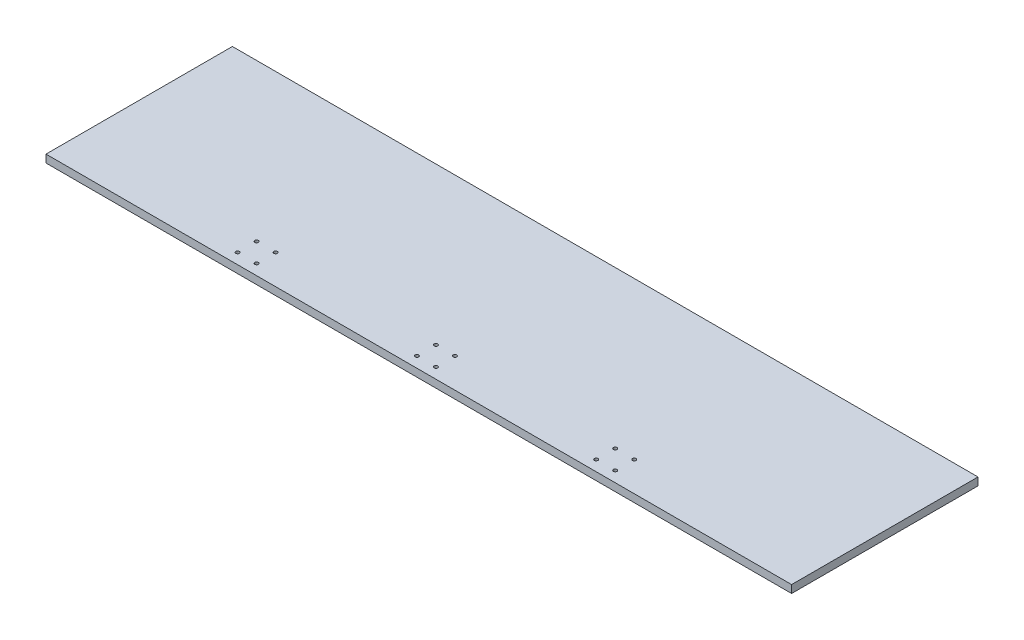
ISO-10303-21;
HEADER;
FILE_DESCRIPTION(('STEP AP214'),'2;1');
FILE_NAME('part.step','',(''),(''),'','','');
FILE_SCHEMA(('AUTOMOTIVE_DESIGN { 1 0 10303 214 1 1 1 1 }'));
ENDSEC;
DATA;
#1=APPLICATION_CONTEXT('core data for automotive mechanical design processes');
#2=APPLICATION_PROTOCOL_DEFINITION('international standard','automotive_design',2000,#1);
#3=PRODUCT_CONTEXT('',#1,'mechanical');
#4=PRODUCT('Part','Part','',(#3));
#5=PRODUCT_RELATED_PRODUCT_CATEGORY('part','',(#4));
#6=PRODUCT_DEFINITION_FORMATION('','',#4);
#7=PRODUCT_DEFINITION_CONTEXT('part definition',#1,'design');
#8=PRODUCT_DEFINITION('design','',#6,#7);
#9=PRODUCT_DEFINITION_SHAPE('','',#8);
#10=(LENGTH_UNIT() NAMED_UNIT(*) SI_UNIT(.MILLI.,.METRE.));
#11=(NAMED_UNIT(*) PLANE_ANGLE_UNIT() SI_UNIT($,.RADIAN.));
#12=(NAMED_UNIT(*) SI_UNIT($,.STERADIAN.) SOLID_ANGLE_UNIT());
#13=UNCERTAINTY_MEASURE_WITH_UNIT(LENGTH_MEASURE(1.E-05),#10,'distance_accuracy_value','');
#14=(GEOMETRIC_REPRESENTATION_CONTEXT(3) GLOBAL_UNCERTAINTY_ASSIGNED_CONTEXT((#13)) GLOBAL_UNIT_ASSIGNED_CONTEXT((#10,
#11,#12)) REPRESENTATION_CONTEXT('',''));
#15=CARTESIAN_POINT('',(0.,0.,0.));
#16=DIRECTION('',(0.,0.,1.));
#17=DIRECTION('',(1.,0.,0.));
#18=AXIS2_PLACEMENT_3D('',#15,#16,#17);
#19=CARTESIAN_POINT('',(0.,6.35,0.));
#20=DIRECTION('',(0.,1.,0.));
#21=DIRECTION('',(0.,0.,1.));
#22=AXIS2_PLACEMENT_3D('',#19,#20,#21);
#23=PLANE('',#22);
#24=CARTESIAN_POINT('',(-156.878174593052,6.35,51.9218254069479));
#25=DIRECTION('',(0.,-1.,0.));
#26=DIRECTION('',(0.,0.,-1.));
#27=AXIS2_PLACEMENT_3D('',#24,#25,#26);
#28=CIRCLE('',#27,1.45000000000001);
#29=CARTESIAN_POINT('',(-156.878174593052,6.35,50.4718254069479));
#30=VERTEX_POINT('',#29);
#31=EDGE_CURVE('E177',#30,#30,#28,.T.);
#32=ORIENTED_EDGE('',*,*,#31,.T.);
#33=EDGE_LOOP('',(#32));
#34=FACE_BOUND('',#33,.T.);
#35=CARTESIAN_POINT('',(-141.321825406948,6.35,51.9218254069479));
#36=DIRECTION('',(0.,-1.,0.));
#37=DIRECTION('',(0.,0.,-1.));
#38=AXIS2_PLACEMENT_3D('',#35,#36,#37);
#39=CIRCLE('',#38,1.45000000000001);
#40=CARTESIAN_POINT('',(-141.321825406948,6.35,50.4718254069479));
#41=VERTEX_POINT('',#40);
#42=EDGE_CURVE('E171',#41,#41,#39,.T.);
#43=ORIENTED_EDGE('',*,*,#42,.T.);
#44=EDGE_LOOP('',(#43));
#45=FACE_BOUND('',#44,.T.);
#46=CARTESIAN_POINT('',(-141.321825406948,6.35,67.4781745930519));
#47=DIRECTION('',(0.,-1.,0.));
#48=DIRECTION('',(0.,0.,-1.));
#49=AXIS2_PLACEMENT_3D('',#46,#47,#48);
#50=CIRCLE('',#49,1.45000000000001);
#51=CARTESIAN_POINT('',(-141.321825406948,6.35,66.0281745930519));
#52=VERTEX_POINT('',#51);
#53=EDGE_CURVE('E165',#52,#52,#50,.T.);
#54=ORIENTED_EDGE('',*,*,#53,.T.);
#55=EDGE_LOOP('',(#54));
#56=FACE_BOUND('',#55,.T.);
#57=CARTESIAN_POINT('',(-156.878174593052,6.35,67.4781745930519));
#58=DIRECTION('',(0.,-1.,0.));
#59=DIRECTION('',(0.,0.,-1.));
#60=AXIS2_PLACEMENT_3D('',#57,#58,#59);
#61=CIRCLE('',#60,1.45000000000001);
#62=CARTESIAN_POINT('',(-156.878174593052,6.35,66.0281745930519));
#63=VERTEX_POINT('',#62);
#64=EDGE_CURVE('E159',#63,#63,#61,.T.);
#65=ORIENTED_EDGE('',*,*,#64,.T.);
#66=EDGE_LOOP('',(#65));
#67=FACE_BOUND('',#66,.T.);
#68=DIRECTION('',(0.,0.,-1.));
#69=VECTOR('',#68,1.);
#70=CARTESIAN_POINT('',(304.8,6.35,-76.2));
#71=LINE('',#70,#69);
#72=CARTESIAN_POINT('',(304.8,6.35,76.2));
#73=VERTEX_POINT('',#72);
#74=CARTESIAN_POINT('',(304.8,6.35,-76.2));
#75=VERTEX_POINT('',#74);
#76=EDGE_CURVE('E86',#73,#75,#71,.T.);
#77=ORIENTED_EDGE('',*,*,#76,.T.);
#78=DIRECTION('',(-1.,0.,0.));
#79=VECTOR('',#78,1.);
#80=CARTESIAN_POINT('',(-304.8,6.35,-76.2));
#81=LINE('',#80,#79);
#82=CARTESIAN_POINT('',(-304.8,6.35,-76.2));
#83=VERTEX_POINT('',#82);
#84=EDGE_CURVE('E81',#75,#83,#81,.T.);
#85=ORIENTED_EDGE('',*,*,#84,.T.);
#86=DIRECTION('',(0.,0.,1.));
#87=VECTOR('',#86,1.);
#88=CARTESIAN_POINT('',(-304.8,6.35,-76.2));
#89=LINE('',#88,#87);
#90=CARTESIAN_POINT('',(-304.8,6.35,76.2));
#91=VERTEX_POINT('',#90);
#92=EDGE_CURVE('E84',#83,#91,#89,.T.);
#93=ORIENTED_EDGE('',*,*,#92,.T.);
#94=DIRECTION('',(1.,0.,0.));
#95=VECTOR('',#94,1.);
#96=CARTESIAN_POINT('',(-304.8,6.35,76.2));
#97=LINE('',#96,#95);
#98=EDGE_CURVE('E51',#91,#73,#97,.T.);
#99=ORIENTED_EDGE('',*,*,#98,.T.);
#100=EDGE_LOOP('',(#77,#85,#93,#99));
#101=FACE_BOUND('',#100,.T.);
#102=CARTESIAN_POINT('',(151.878174593052,6.35,51.9218254069479));
#103=DIRECTION('',(0.,-1.,0.));
#104=DIRECTION('',(0.,0.,-1.));
#105=AXIS2_PLACEMENT_3D('',#102,#103,#104);
#106=CIRCLE('',#105,1.45000000000001);
#107=CARTESIAN_POINT('',(151.878174593052,6.35,50.4718254069479));
#108=VERTEX_POINT('',#107);
#109=EDGE_CURVE('E101',#108,#108,#106,.T.);
#110=ORIENTED_EDGE('',*,*,#109,.T.);
#111=EDGE_LOOP('',(#110));
#112=FACE_BOUND('',#111,.T.);
#113=CARTESIAN_POINT('',(151.878174593052,6.35,67.4781745930519));
#114=DIRECTION('',(0.,-1.,0.));
#115=DIRECTION('',(0.,0.,-1.));
#116=AXIS2_PLACEMENT_3D('',#113,#114,#115);
#117=CIRCLE('',#116,1.45000000000001);
#118=CARTESIAN_POINT('',(151.878174593052,6.35,66.0281745930519));
#119=VERTEX_POINT('',#118);
#120=EDGE_CURVE('E117',#119,#119,#117,.T.);
#121=ORIENTED_EDGE('',*,*,#120,.T.);
#122=EDGE_LOOP('',(#121));
#123=FACE_BOUND('',#122,.T.);
#124=CARTESIAN_POINT('',(136.321825406948,6.35,67.4781745930519));
#125=DIRECTION('',(0.,-1.,0.));
#126=DIRECTION('',(0.,0.,-1.));
#127=AXIS2_PLACEMENT_3D('',#124,#125,#126);
#128=CIRCLE('',#127,1.45000000000001);
#129=CARTESIAN_POINT('',(136.321825406948,6.35,66.0281745930519));
#130=VERTEX_POINT('',#129);
#131=EDGE_CURVE('E123',#130,#130,#128,.T.);
#132=ORIENTED_EDGE('',*,*,#131,.T.);
#133=EDGE_LOOP('',(#132));
#134=FACE_BOUND('',#133,.T.);
#135=CARTESIAN_POINT('',(136.321825406948,6.35,51.9218254069479));
#136=DIRECTION('',(0.,-1.,0.));
#137=DIRECTION('',(0.,0.,-1.));
#138=AXIS2_PLACEMENT_3D('',#135,#136,#137);
#139=CIRCLE('',#138,1.45000000000001);
#140=CARTESIAN_POINT('',(136.321825406948,6.35,50.4718254069479));
#141=VERTEX_POINT('',#140);
#142=EDGE_CURVE('E129',#141,#141,#139,.T.);
#143=ORIENTED_EDGE('',*,*,#142,.T.);
#144=EDGE_LOOP('',(#143));
#145=FACE_BOUND('',#144,.T.);
#146=CARTESIAN_POINT('',(5.278174593052,6.35,51.921825406948));
#147=DIRECTION('',(0.,-1.,0.));
#148=DIRECTION('',(0.,0.,-1.));
#149=AXIS2_PLACEMENT_3D('',#146,#147,#148);
#150=CIRCLE('',#149,1.45);
#151=CARTESIAN_POINT('',(5.278174593052,6.35,50.471825406948));
#152=VERTEX_POINT('',#151);
#153=EDGE_CURVE('E135',#152,#152,#150,.T.);
#154=ORIENTED_EDGE('',*,*,#153,.T.);
#155=EDGE_LOOP('',(#154));
#156=FACE_BOUND('',#155,.T.);
#157=CARTESIAN_POINT('',(5.278174593052,6.35,67.478174593052));
#158=DIRECTION('',(0.,-1.,0.));
#159=DIRECTION('',(0.,0.,-1.));
#160=AXIS2_PLACEMENT_3D('',#157,#158,#159);
#161=CIRCLE('',#160,1.45);
#162=CARTESIAN_POINT('',(5.278174593052,6.35,66.028174593052));
#163=VERTEX_POINT('',#162);
#164=EDGE_CURVE('E141',#163,#163,#161,.T.);
#165=ORIENTED_EDGE('',*,*,#164,.T.);
#166=EDGE_LOOP('',(#165));
#167=FACE_BOUND('',#166,.T.);
#168=CARTESIAN_POINT('',(-10.278174593052,6.35,67.478174593052));
#169=DIRECTION('',(0.,-1.,0.));
#170=DIRECTION('',(0.,0.,-1.));
#171=AXIS2_PLACEMENT_3D('',#168,#169,#170);
#172=CIRCLE('',#171,1.45);
#173=CARTESIAN_POINT('',(-10.278174593052,6.35,66.028174593052));
#174=VERTEX_POINT('',#173);
#175=EDGE_CURVE('E147',#174,#174,#172,.T.);
#176=ORIENTED_EDGE('',*,*,#175,.T.);
#177=EDGE_LOOP('',(#176));
#178=FACE_BOUND('',#177,.T.);
#179=CARTESIAN_POINT('',(-10.278174593052,6.35,51.921825406948));
#180=DIRECTION('',(0.,-1.,0.));
#181=DIRECTION('',(0.,0.,-1.));
#182=AXIS2_PLACEMENT_3D('',#179,#180,#181);
#183=CIRCLE('',#182,1.45);
#184=CARTESIAN_POINT('',(-10.278174593052,6.35,50.471825406948));
#185=VERTEX_POINT('',#184);
#186=EDGE_CURVE('E153',#185,#185,#183,.T.);
#187=ORIENTED_EDGE('',*,*,#186,.T.);
#188=EDGE_LOOP('',(#187));
#189=FACE_BOUND('',#188,.T.);
#190=ADVANCED_FACE('F34',(#34,#45,#56,#67,#101,#112,#123,#134,#145,#156,#167,#178,#189),#23,.T.);
#191=CARTESIAN_POINT('',(304.8,6.35,-76.2));
#192=DIRECTION('',(-1.,0.,0.));
#193=DIRECTION('',(0.,0.,1.));
#194=AXIS2_PLACEMENT_3D('',#191,#192,#193);
#195=PLANE('',#194);
#196=DIRECTION('',(0.,0.,-1.));
#197=VECTOR('',#196,1.);
#198=CARTESIAN_POINT('',(304.8,0.,-76.2));
#199=LINE('',#198,#197);
#200=CARTESIAN_POINT('',(304.8,0.,76.2));
#201=VERTEX_POINT('',#200);
#202=CARTESIAN_POINT('',(304.8,0.,-76.2));
#203=VERTEX_POINT('',#202);
#204=EDGE_CURVE('E98',#201,#203,#199,.T.);
#205=ORIENTED_EDGE('',*,*,#204,.T.);
#206=DIRECTION('',(0.,-1.,0.));
#207=VECTOR('',#206,1.);
#208=CARTESIAN_POINT('',(304.8,6.35,-76.2));
#209=LINE('',#208,#207);
#210=EDGE_CURVE('E11',#75,#203,#209,.T.);
#211=ORIENTED_EDGE('',*,*,#210,.F.);
#212=ORIENTED_EDGE('',*,*,#76,.F.);
#213=DIRECTION('',(0.,-1.,0.));
#214=VECTOR('',#213,1.);
#215=CARTESIAN_POINT('',(304.8,6.35,76.2));
#216=LINE('',#215,#214);
#217=EDGE_CURVE('E94',#73,#201,#216,.T.);
#218=ORIENTED_EDGE('',*,*,#217,.T.);
#219=EDGE_LOOP('',(#205,#211,#212,#218));
#220=FACE_BOUND('',#219,.T.);
#221=ADVANCED_FACE('F36',(#220),#195,.F.);
#222=CARTESIAN_POINT('',(-304.8,6.35,-76.2));
#223=DIRECTION('',(0.,0.,1.));
#224=DIRECTION('',(1.,0.,0.));
#225=AXIS2_PLACEMENT_3D('',#222,#223,#224);
#226=PLANE('',#225);
#227=DIRECTION('',(-1.,0.,0.));
#228=VECTOR('',#227,1.);
#229=CARTESIAN_POINT('',(-304.8,0.,-76.2));
#230=LINE('',#229,#228);
#231=CARTESIAN_POINT('',(-304.8,0.,-76.2));
#232=VERTEX_POINT('',#231);
#233=EDGE_CURVE('E90',#203,#232,#230,.T.);
#234=ORIENTED_EDGE('',*,*,#233,.T.);
#235=DIRECTION('',(0.,-1.,0.));
#236=VECTOR('',#235,1.);
#237=CARTESIAN_POINT('',(-304.8,6.35,-76.2));
#238=LINE('',#237,#236);
#239=EDGE_CURVE('E43',#83,#232,#238,.T.);
#240=ORIENTED_EDGE('',*,*,#239,.F.);
#241=ORIENTED_EDGE('',*,*,#84,.F.);
#242=ORIENTED_EDGE('',*,*,#210,.T.);
#243=EDGE_LOOP('',(#234,#240,#241,#242));
#244=FACE_BOUND('',#243,.T.);
#245=ADVANCED_FACE('F89',(#244),#226,.F.);
#246=CARTESIAN_POINT('',(-304.8,6.35,-76.2));
#247=DIRECTION('',(1.,0.,0.));
#248=DIRECTION('',(0.,0.,-1.));
#249=AXIS2_PLACEMENT_3D('',#246,#247,#248);
#250=PLANE('',#249);
#251=DIRECTION('',(0.,0.,1.));
#252=VECTOR('',#251,1.);
#253=CARTESIAN_POINT('',(-304.8,0.,-76.2));
#254=LINE('',#253,#252);
#255=CARTESIAN_POINT('',(-304.8,0.,76.2));
#256=VERTEX_POINT('',#255);
#257=EDGE_CURVE('E68',#232,#256,#254,.T.);
#258=ORIENTED_EDGE('',*,*,#257,.T.);
#259=DIRECTION('',(0.,-1.,0.));
#260=VECTOR('',#259,1.);
#261=CARTESIAN_POINT('',(-304.8,6.35,76.2));
#262=LINE('',#261,#260);
#263=EDGE_CURVE('E91',#91,#256,#262,.T.);
#264=ORIENTED_EDGE('',*,*,#263,.F.);
#265=ORIENTED_EDGE('',*,*,#92,.F.);
#266=ORIENTED_EDGE('',*,*,#239,.T.);
#267=EDGE_LOOP('',(#258,#264,#265,#266));
#268=FACE_BOUND('',#267,.T.);
#269=ADVANCED_FACE('F92',(#268),#250,.F.);
#270=CARTESIAN_POINT('',(-304.8,6.35,76.2));
#271=DIRECTION('',(0.,0.,-1.));
#272=DIRECTION('',(-1.,0.,0.));
#273=AXIS2_PLACEMENT_3D('',#270,#271,#272);
#274=PLANE('',#273);
#275=DIRECTION('',(1.,0.,0.));
#276=VECTOR('',#275,1.);
#277=CARTESIAN_POINT('',(-304.8,0.,76.2));
#278=LINE('',#277,#276);
#279=EDGE_CURVE('E74',#256,#201,#278,.T.);
#280=ORIENTED_EDGE('',*,*,#279,.T.);
#281=ORIENTED_EDGE('',*,*,#217,.F.);
#282=ORIENTED_EDGE('',*,*,#98,.F.);
#283=ORIENTED_EDGE('',*,*,#263,.T.);
#284=EDGE_LOOP('',(#280,#281,#282,#283));
#285=FACE_BOUND('',#284,.T.);
#286=ADVANCED_FACE('F106',(#285),#274,.F.);
#287=CARTESIAN_POINT('',(0.,0.,0.));
#288=DIRECTION('',(0.,1.,0.));
#289=DIRECTION('',(0.,0.,1.));
#290=AXIS2_PLACEMENT_3D('',#287,#288,#289);
#291=PLANE('',#290);
#292=CARTESIAN_POINT('',(-156.878174593052,0.,51.9218254069479));
#293=DIRECTION('',(0.,-1.,0.));
#294=DIRECTION('',(0.,0.,-1.));
#295=AXIS2_PLACEMENT_3D('',#292,#293,#294);
#296=CIRCLE('',#295,1.45000000000001);
#297=CARTESIAN_POINT('',(-156.878174593052,0.,50.4718254069479));
#298=VERTEX_POINT('',#297);
#299=EDGE_CURVE('E180',#298,#298,#296,.T.);
#300=ORIENTED_EDGE('',*,*,#299,.F.);
#301=EDGE_LOOP('',(#300));
#302=FACE_BOUND('',#301,.T.);
#303=CARTESIAN_POINT('',(-141.321825406948,0.,51.9218254069479));
#304=DIRECTION('',(0.,-1.,0.));
#305=DIRECTION('',(0.,0.,-1.));
#306=AXIS2_PLACEMENT_3D('',#303,#304,#305);
#307=CIRCLE('',#306,1.45000000000001);
#308=CARTESIAN_POINT('',(-141.321825406948,0.,50.4718254069479));
#309=VERTEX_POINT('',#308);
#310=EDGE_CURVE('E174',#309,#309,#307,.T.);
#311=ORIENTED_EDGE('',*,*,#310,.F.);
#312=EDGE_LOOP('',(#311));
#313=FACE_BOUND('',#312,.T.);
#314=CARTESIAN_POINT('',(-141.321825406948,0.,67.4781745930519));
#315=DIRECTION('',(0.,-1.,0.));
#316=DIRECTION('',(0.,0.,-1.));
#317=AXIS2_PLACEMENT_3D('',#314,#315,#316);
#318=CIRCLE('',#317,1.45000000000001);
#319=CARTESIAN_POINT('',(-141.321825406948,0.,66.0281745930519));
#320=VERTEX_POINT('',#319);
#321=EDGE_CURVE('E168',#320,#320,#318,.T.);
#322=ORIENTED_EDGE('',*,*,#321,.F.);
#323=EDGE_LOOP('',(#322));
#324=FACE_BOUND('',#323,.T.);
#325=CARTESIAN_POINT('',(-156.878174593052,0.,67.4781745930519));
#326=DIRECTION('',(0.,-1.,0.));
#327=DIRECTION('',(0.,0.,-1.));
#328=AXIS2_PLACEMENT_3D('',#325,#326,#327);
#329=CIRCLE('',#328,1.45000000000001);
#330=CARTESIAN_POINT('',(-156.878174593052,0.,66.0281745930519));
#331=VERTEX_POINT('',#330);
#332=EDGE_CURVE('E162',#331,#331,#329,.T.);
#333=ORIENTED_EDGE('',*,*,#332,.F.);
#334=EDGE_LOOP('',(#333));
#335=FACE_BOUND('',#334,.T.);
#336=CARTESIAN_POINT('',(-10.278174593052,0.,51.921825406948));
#337=DIRECTION('',(0.,-1.,0.));
#338=DIRECTION('',(0.,0.,-1.));
#339=AXIS2_PLACEMENT_3D('',#336,#337,#338);
#340=CIRCLE('',#339,1.45);
#341=CARTESIAN_POINT('',(-10.278174593052,0.,50.471825406948));
#342=VERTEX_POINT('',#341);
#343=EDGE_CURVE('E156',#342,#342,#340,.T.);
#344=ORIENTED_EDGE('',*,*,#343,.F.);
#345=EDGE_LOOP('',(#344));
#346=FACE_BOUND('',#345,.T.);
#347=CARTESIAN_POINT('',(-10.278174593052,0.,67.478174593052));
#348=DIRECTION('',(0.,-1.,0.));
#349=DIRECTION('',(0.,0.,-1.));
#350=AXIS2_PLACEMENT_3D('',#347,#348,#349);
#351=CIRCLE('',#350,1.45);
#352=CARTESIAN_POINT('',(-10.278174593052,0.,66.028174593052));
#353=VERTEX_POINT('',#352);
#354=EDGE_CURVE('E150',#353,#353,#351,.T.);
#355=ORIENTED_EDGE('',*,*,#354,.F.);
#356=EDGE_LOOP('',(#355));
#357=FACE_BOUND('',#356,.T.);
#358=CARTESIAN_POINT('',(5.278174593052,0.,67.478174593052));
#359=DIRECTION('',(0.,-1.,0.));
#360=DIRECTION('',(0.,0.,-1.));
#361=AXIS2_PLACEMENT_3D('',#358,#359,#360);
#362=CIRCLE('',#361,1.45);
#363=CARTESIAN_POINT('',(5.278174593052,0.,66.028174593052));
#364=VERTEX_POINT('',#363);
#365=EDGE_CURVE('E144',#364,#364,#362,.T.);
#366=ORIENTED_EDGE('',*,*,#365,.F.);
#367=EDGE_LOOP('',(#366));
#368=FACE_BOUND('',#367,.T.);
#369=CARTESIAN_POINT('',(5.278174593052,0.,51.921825406948));
#370=DIRECTION('',(0.,-1.,0.));
#371=DIRECTION('',(0.,0.,-1.));
#372=AXIS2_PLACEMENT_3D('',#369,#370,#371);
#373=CIRCLE('',#372,1.45);
#374=CARTESIAN_POINT('',(5.278174593052,0.,50.471825406948));
#375=VERTEX_POINT('',#374);
#376=EDGE_CURVE('E138',#375,#375,#373,.T.);
#377=ORIENTED_EDGE('',*,*,#376,.F.);
#378=EDGE_LOOP('',(#377));
#379=FACE_BOUND('',#378,.T.);
#380=CARTESIAN_POINT('',(136.321825406948,0.,51.9218254069479));
#381=DIRECTION('',(0.,-1.,0.));
#382=DIRECTION('',(0.,0.,-1.));
#383=AXIS2_PLACEMENT_3D('',#380,#381,#382);
#384=CIRCLE('',#383,1.45000000000001);
#385=CARTESIAN_POINT('',(136.321825406948,0.,50.4718254069479));
#386=VERTEX_POINT('',#385);
#387=EDGE_CURVE('E132',#386,#386,#384,.T.);
#388=ORIENTED_EDGE('',*,*,#387,.F.);
#389=EDGE_LOOP('',(#388));
#390=FACE_BOUND('',#389,.T.);
#391=CARTESIAN_POINT('',(136.321825406948,0.,67.4781745930519));
#392=DIRECTION('',(0.,-1.,0.));
#393=DIRECTION('',(0.,0.,-1.));
#394=AXIS2_PLACEMENT_3D('',#391,#392,#393);
#395=CIRCLE('',#394,1.45000000000001);
#396=CARTESIAN_POINT('',(136.321825406948,0.,66.0281745930519));
#397=VERTEX_POINT('',#396);
#398=EDGE_CURVE('E126',#397,#397,#395,.T.);
#399=ORIENTED_EDGE('',*,*,#398,.F.);
#400=EDGE_LOOP('',(#399));
#401=FACE_BOUND('',#400,.T.);
#402=CARTESIAN_POINT('',(151.878174593052,0.,67.4781745930519));
#403=DIRECTION('',(0.,-1.,0.));
#404=DIRECTION('',(0.,0.,-1.));
#405=AXIS2_PLACEMENT_3D('',#402,#403,#404);
#406=CIRCLE('',#405,1.45000000000001);
#407=CARTESIAN_POINT('',(151.878174593052,0.,66.0281745930519));
#408=VERTEX_POINT('',#407);
#409=EDGE_CURVE('E120',#408,#408,#406,.T.);
#410=ORIENTED_EDGE('',*,*,#409,.F.);
#411=EDGE_LOOP('',(#410));
#412=FACE_BOUND('',#411,.T.);
#413=CARTESIAN_POINT('',(151.878174593052,0.,51.9218254069479));
#414=DIRECTION('',(0.,-1.,0.));
#415=DIRECTION('',(0.,0.,-1.));
#416=AXIS2_PLACEMENT_3D('',#413,#414,#415);
#417=CIRCLE('',#416,1.45000000000001);
#418=CARTESIAN_POINT('',(151.878174593052,0.,50.4718254069479));
#419=VERTEX_POINT('',#418);
#420=EDGE_CURVE('E114',#419,#419,#417,.T.);
#421=ORIENTED_EDGE('',*,*,#420,.F.);
#422=EDGE_LOOP('',(#421));
#423=FACE_BOUND('',#422,.T.);
#424=ORIENTED_EDGE('',*,*,#204,.F.);
#425=ORIENTED_EDGE('',*,*,#279,.F.);
#426=ORIENTED_EDGE('',*,*,#257,.F.);
#427=ORIENTED_EDGE('',*,*,#233,.F.);
#428=EDGE_LOOP('',(#424,#425,#426,#427));
#429=FACE_BOUND('',#428,.T.);
#430=ADVANCED_FACE('F109',(#302,#313,#324,#335,#346,#357,#368,#379,#390,#401,#412,#423,#429),
#291,.F.);
#431=CARTESIAN_POINT('',(151.878174593052,0.,51.9218254069479));
#432=DIRECTION('',(0.,-1.,0.));
#433=DIRECTION('',(0.,0.,-1.));
#434=AXIS2_PLACEMENT_3D('',#431,#432,#433);
#435=CYLINDRICAL_SURFACE('',#434,1.45000000000001);
#436=ORIENTED_EDGE('',*,*,#109,.F.);
#437=EDGE_LOOP('',(#436));
#438=FACE_BOUND('',#437,.T.);
#439=ORIENTED_EDGE('',*,*,#420,.T.);
#440=EDGE_LOOP('',(#439));
#441=FACE_BOUND('',#440,.T.);
#442=ADVANCED_FACE('F188',(#438,#441),#435,.F.);
#443=CARTESIAN_POINT('',(151.878174593052,0.,67.4781745930519));
#444=DIRECTION('',(0.,-1.,0.));
#445=DIRECTION('',(0.,0.,-1.));
#446=AXIS2_PLACEMENT_3D('',#443,#444,#445);
#447=CYLINDRICAL_SURFACE('',#446,1.45000000000001);
#448=ORIENTED_EDGE('',*,*,#120,.F.);
#449=EDGE_LOOP('',(#448));
#450=FACE_BOUND('',#449,.T.);
#451=ORIENTED_EDGE('',*,*,#409,.T.);
#452=EDGE_LOOP('',(#451));
#453=FACE_BOUND('',#452,.T.);
#454=ADVANCED_FACE('F213',(#450,#453),#447,.F.);
#455=CARTESIAN_POINT('',(136.321825406948,0.,67.4781745930519));
#456=DIRECTION('',(0.,-1.,0.));
#457=DIRECTION('',(0.,0.,-1.));
#458=AXIS2_PLACEMENT_3D('',#455,#456,#457);
#459=CYLINDRICAL_SURFACE('',#458,1.45000000000001);
#460=ORIENTED_EDGE('',*,*,#131,.F.);
#461=EDGE_LOOP('',(#460));
#462=FACE_BOUND('',#461,.T.);
#463=ORIENTED_EDGE('',*,*,#398,.T.);
#464=EDGE_LOOP('',(#463));
#465=FACE_BOUND('',#464,.T.);
#466=ADVANCED_FACE('F219',(#462,#465),#459,.F.);
#467=CARTESIAN_POINT('',(136.321825406948,0.,51.9218254069479));
#468=DIRECTION('',(0.,-1.,0.));
#469=DIRECTION('',(0.,0.,-1.));
#470=AXIS2_PLACEMENT_3D('',#467,#468,#469);
#471=CYLINDRICAL_SURFACE('',#470,1.45000000000001);
#472=ORIENTED_EDGE('',*,*,#142,.F.);
#473=EDGE_LOOP('',(#472));
#474=FACE_BOUND('',#473,.T.);
#475=ORIENTED_EDGE('',*,*,#387,.T.);
#476=EDGE_LOOP('',(#475));
#477=FACE_BOUND('',#476,.T.);
#478=ADVANCED_FACE('F272',(#474,#477),#471,.F.);
#479=CARTESIAN_POINT('',(5.278174593052,0.,51.921825406948));
#480=DIRECTION('',(0.,-1.,0.));
#481=DIRECTION('',(0.,0.,-1.));
#482=AXIS2_PLACEMENT_3D('',#479,#480,#481);
#483=CYLINDRICAL_SURFACE('',#482,1.45);
#484=ORIENTED_EDGE('',*,*,#153,.F.);
#485=EDGE_LOOP('',(#484));
#486=FACE_BOUND('',#485,.T.);
#487=ORIENTED_EDGE('',*,*,#376,.T.);
#488=EDGE_LOOP('',(#487));
#489=FACE_BOUND('',#488,.T.);
#490=ADVANCED_FACE('F282',(#486,#489),#483,.F.);
#491=CARTESIAN_POINT('',(5.278174593052,0.,67.478174593052));
#492=DIRECTION('',(0.,-1.,0.));
#493=DIRECTION('',(0.,0.,-1.));
#494=AXIS2_PLACEMENT_3D('',#491,#492,#493);
#495=CYLINDRICAL_SURFACE('',#494,1.45);
#496=ORIENTED_EDGE('',*,*,#164,.F.);
#497=EDGE_LOOP('',(#496));
#498=FACE_BOUND('',#497,.T.);
#499=ORIENTED_EDGE('',*,*,#365,.T.);
#500=EDGE_LOOP('',(#499));
#501=FACE_BOUND('',#500,.T.);
#502=ADVANCED_FACE('F292',(#498,#501),#495,.F.);
#503=CARTESIAN_POINT('',(-10.278174593052,0.,67.478174593052));
#504=DIRECTION('',(0.,-1.,0.));
#505=DIRECTION('',(0.,0.,-1.));
#506=AXIS2_PLACEMENT_3D('',#503,#504,#505);
#507=CYLINDRICAL_SURFACE('',#506,1.45);
#508=ORIENTED_EDGE('',*,*,#175,.F.);
#509=EDGE_LOOP('',(#508));
#510=FACE_BOUND('',#509,.T.);
#511=ORIENTED_EDGE('',*,*,#354,.T.);
#512=EDGE_LOOP('',(#511));
#513=FACE_BOUND('',#512,.T.);
#514=ADVANCED_FACE('F302',(#510,#513),#507,.F.);
#515=CARTESIAN_POINT('',(-10.278174593052,0.,51.921825406948));
#516=DIRECTION('',(0.,-1.,0.));
#517=DIRECTION('',(0.,0.,-1.));
#518=AXIS2_PLACEMENT_3D('',#515,#516,#517);
#519=CYLINDRICAL_SURFACE('',#518,1.45);
#520=ORIENTED_EDGE('',*,*,#186,.F.);
#521=EDGE_LOOP('',(#520));
#522=FACE_BOUND('',#521,.T.);
#523=ORIENTED_EDGE('',*,*,#343,.T.);
#524=EDGE_LOOP('',(#523));
#525=FACE_BOUND('',#524,.T.);
#526=ADVANCED_FACE('F312',(#522,#525),#519,.F.);
#527=CARTESIAN_POINT('',(-156.878174593052,0.,67.4781745930519));
#528=DIRECTION('',(0.,-1.,0.));
#529=DIRECTION('',(0.,0.,-1.));
#530=AXIS2_PLACEMENT_3D('',#527,#528,#529);
#531=CYLINDRICAL_SURFACE('',#530,1.45000000000001);
#532=ORIENTED_EDGE('',*,*,#64,.F.);
#533=EDGE_LOOP('',(#532));
#534=FACE_BOUND('',#533,.T.);
#535=ORIENTED_EDGE('',*,*,#332,.T.);
#536=EDGE_LOOP('',(#535));
#537=FACE_BOUND('',#536,.T.);
#538=ADVANCED_FACE('F322',(#534,#537),#531,.F.);
#539=CARTESIAN_POINT('',(-141.321825406948,0.,67.4781745930519));
#540=DIRECTION('',(0.,-1.,0.));
#541=DIRECTION('',(0.,0.,-1.));
#542=AXIS2_PLACEMENT_3D('',#539,#540,#541);
#543=CYLINDRICAL_SURFACE('',#542,1.45000000000001);
#544=ORIENTED_EDGE('',*,*,#53,.F.);
#545=EDGE_LOOP('',(#544));
#546=FACE_BOUND('',#545,.T.);
#547=ORIENTED_EDGE('',*,*,#321,.T.);
#548=EDGE_LOOP('',(#547));
#549=FACE_BOUND('',#548,.T.);
#550=ADVANCED_FACE('F332',(#546,#549),#543,.F.);
#551=CARTESIAN_POINT('',(-141.321825406948,0.,51.9218254069479));
#552=DIRECTION('',(0.,-1.,0.));
#553=DIRECTION('',(0.,0.,-1.));
#554=AXIS2_PLACEMENT_3D('',#551,#552,#553);
#555=CYLINDRICAL_SURFACE('',#554,1.45000000000001);
#556=ORIENTED_EDGE('',*,*,#42,.F.);
#557=EDGE_LOOP('',(#556));
#558=FACE_BOUND('',#557,.T.);
#559=ORIENTED_EDGE('',*,*,#310,.T.);
#560=EDGE_LOOP('',(#559));
#561=FACE_BOUND('',#560,.T.);
#562=ADVANCED_FACE('F342',(#558,#561),#555,.F.);
#563=CARTESIAN_POINT('',(-156.878174593052,0.,51.9218254069479));
#564=DIRECTION('',(0.,-1.,0.));
#565=DIRECTION('',(0.,0.,-1.));
#566=AXIS2_PLACEMENT_3D('',#563,#564,#565);
#567=CYLINDRICAL_SURFACE('',#566,1.45000000000001);
#568=ORIENTED_EDGE('',*,*,#31,.F.);
#569=EDGE_LOOP('',(#568));
#570=FACE_BOUND('',#569,.T.);
#571=ORIENTED_EDGE('',*,*,#299,.T.);
#572=EDGE_LOOP('',(#571));
#573=FACE_BOUND('',#572,.T.);
#574=ADVANCED_FACE('F184',(#570,#573),#567,.F.);
#575=CLOSED_SHELL('',(#190,#221,#245,#269,#286,#430,#442,#454,#466,#478,#490,#502,#514,#526,
#538,#550,#562,#574));
#576=MANIFOLD_SOLID_BREP('B2',#575);
#577=ADVANCED_BREP_SHAPE_REPRESENTATION('',(#18,#576),#14);
#578=SHAPE_DEFINITION_REPRESENTATION(#9,#577);
ENDSEC;
END-ISO-10303-21;
